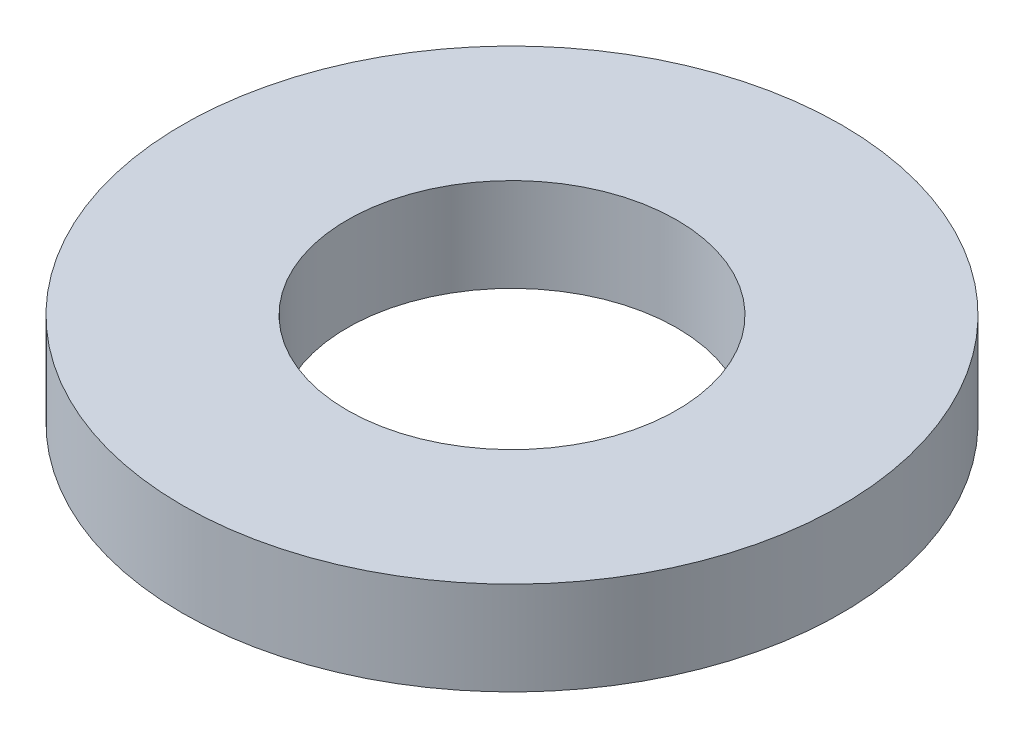
ISO-10303-21;
HEADER;
FILE_DESCRIPTION(('STEP AP214'),'2;1');
FILE_NAME('part.step','',(''),(''),'','','');
FILE_SCHEMA(('AUTOMOTIVE_DESIGN { 1 0 10303 214 1 1 1 1 }'));
ENDSEC;
DATA;
#1=APPLICATION_CONTEXT('core data for automotive mechanical design processes');
#2=APPLICATION_PROTOCOL_DEFINITION('international standard','automotive_design',2000,#1);
#3=PRODUCT_CONTEXT('',#1,'mechanical');
#4=PRODUCT('Part','Part','',(#3));
#5=PRODUCT_RELATED_PRODUCT_CATEGORY('part','',(#4));
#6=PRODUCT_DEFINITION_FORMATION('','',#4);
#7=PRODUCT_DEFINITION_CONTEXT('part definition',#1,'design');
#8=PRODUCT_DEFINITION('design','',#6,#7);
#9=PRODUCT_DEFINITION_SHAPE('','',#8);
#10=(LENGTH_UNIT() NAMED_UNIT(*) SI_UNIT(.MILLI.,.METRE.));
#11=(NAMED_UNIT(*) PLANE_ANGLE_UNIT() SI_UNIT($,.RADIAN.));
#12=(NAMED_UNIT(*) SI_UNIT($,.STERADIAN.) SOLID_ANGLE_UNIT());
#13=UNCERTAINTY_MEASURE_WITH_UNIT(LENGTH_MEASURE(1.E-05),#10,'distance_accuracy_value','');
#14=(GEOMETRIC_REPRESENTATION_CONTEXT(3) GLOBAL_UNCERTAINTY_ASSIGNED_CONTEXT((#13)) GLOBAL_UNIT_ASSIGNED_CONTEXT((#10,
#11,#12)) REPRESENTATION_CONTEXT('',''));
#15=CARTESIAN_POINT('',(0.,0.,0.));
#16=DIRECTION('',(0.,0.,1.));
#17=DIRECTION('',(1.,0.,0.));
#18=AXIS2_PLACEMENT_3D('',#15,#16,#17);
#19=CARTESIAN_POINT('',(0.,17.,0.));
#20=DIRECTION('',(0.,-1.,0.));
#21=DIRECTION('',(0.,0.,-1.));
#22=AXIS2_PLACEMENT_3D('',#19,#20,#21);
#23=CYLINDRICAL_SURFACE('',#22,60.);
#24=CARTESIAN_POINT('',(0.,17.,0.));
#25=DIRECTION('',(0.,1.,0.));
#26=DIRECTION('',(0.,0.,1.));
#27=AXIS2_PLACEMENT_3D('',#24,#25,#26);
#28=CIRCLE('',#27,60.);
#29=CARTESIAN_POINT('',(0.,17.,60.));
#30=VERTEX_POINT('',#29);
#31=EDGE_CURVE('E10',#30,#30,#28,.T.);
#32=ORIENTED_EDGE('',*,*,#31,.F.);
#33=EDGE_LOOP('',(#32));
#34=FACE_BOUND('',#33,.T.);
#35=CARTESIAN_POINT('',(0.,0.,0.));
#36=DIRECTION('',(0.,1.,0.));
#37=DIRECTION('',(0.,0.,1.));
#38=AXIS2_PLACEMENT_3D('',#35,#36,#37);
#39=CIRCLE('',#38,60.);
#40=CARTESIAN_POINT('',(0.,0.,60.));
#41=VERTEX_POINT('',#40);
#42=EDGE_CURVE('E37',#41,#41,#39,.T.);
#43=ORIENTED_EDGE('',*,*,#42,.T.);
#44=EDGE_LOOP('',(#43));
#45=FACE_BOUND('',#44,.T.);
#46=ADVANCED_FACE('F40',(#34,#45),#23,.T.);
#47=CARTESIAN_POINT('',(0.,17.,0.));
#48=DIRECTION('',(0.,1.,0.));
#49=DIRECTION('',(0.,0.,1.));
#50=AXIS2_PLACEMENT_3D('',#47,#48,#49);
#51=PLANE('',#50);
#52=CARTESIAN_POINT('',(0.,17.,0.));
#53=DIRECTION('',(0.,1.,0.));
#54=DIRECTION('',(0.,0.,1.));
#55=AXIS2_PLACEMENT_3D('',#52,#53,#54);
#56=CIRCLE('',#55,30.);
#57=CARTESIAN_POINT('',(0.,17.,30.));
#58=VERTEX_POINT('',#57);
#59=EDGE_CURVE('E50',#58,#58,#56,.T.);
#60=ORIENTED_EDGE('',*,*,#59,.F.);
#61=EDGE_LOOP('',(#60));
#62=FACE_BOUND('',#61,.T.);
#63=ORIENTED_EDGE('',*,*,#31,.T.);
#64=EDGE_LOOP('',(#63));
#65=FACE_BOUND('',#64,.T.);
#66=ADVANCED_FACE('F59',(#62,#65),#51,.T.);
#67=CARTESIAN_POINT('',(0.,0.,0.));
#68=DIRECTION('',(0.,1.,0.));
#69=DIRECTION('',(0.,0.,1.));
#70=AXIS2_PLACEMENT_3D('',#67,#68,#69);
#71=PLANE('',#70);
#72=CARTESIAN_POINT('',(0.,0.,0.));
#73=DIRECTION('',(0.,1.,0.));
#74=DIRECTION('',(0.,0.,1.));
#75=AXIS2_PLACEMENT_3D('',#72,#73,#74);
#76=CIRCLE('',#75,30.);
#77=CARTESIAN_POINT('',(0.,0.,30.));
#78=VERTEX_POINT('',#77);
#79=EDGE_CURVE('E47',#78,#78,#76,.T.);
#80=ORIENTED_EDGE('',*,*,#79,.T.);
#81=EDGE_LOOP('',(#80));
#82=FACE_BOUND('',#81,.T.);
#83=ORIENTED_EDGE('',*,*,#42,.F.);
#84=EDGE_LOOP('',(#83));
#85=FACE_BOUND('',#84,.T.);
#86=ADVANCED_FACE('F58',(#82,#85),#71,.F.);
#87=CARTESIAN_POINT('',(0.,17.,0.));
#88=DIRECTION('',(0.,-1.,0.));
#89=DIRECTION('',(0.,0.,-1.));
#90=AXIS2_PLACEMENT_3D('',#87,#88,#89);
#91=CYLINDRICAL_SURFACE('',#90,30.);
#92=ORIENTED_EDGE('',*,*,#59,.T.);
#93=EDGE_LOOP('',(#92));
#94=FACE_BOUND('',#93,.T.);
#95=ORIENTED_EDGE('',*,*,#79,.F.);
#96=EDGE_LOOP('',(#95));
#97=FACE_BOUND('',#96,.T.);
#98=ADVANCED_FACE('F54',(#94,#97),#91,.F.);
#99=CLOSED_SHELL('',(#46,#66,#86,#98));
#100=MANIFOLD_SOLID_BREP('B2',#99);
#101=ADVANCED_BREP_SHAPE_REPRESENTATION('',(#18,#100),#14);
#102=SHAPE_DEFINITION_REPRESENTATION(#9,#101);
ENDSEC;
END-ISO-10303-21;
